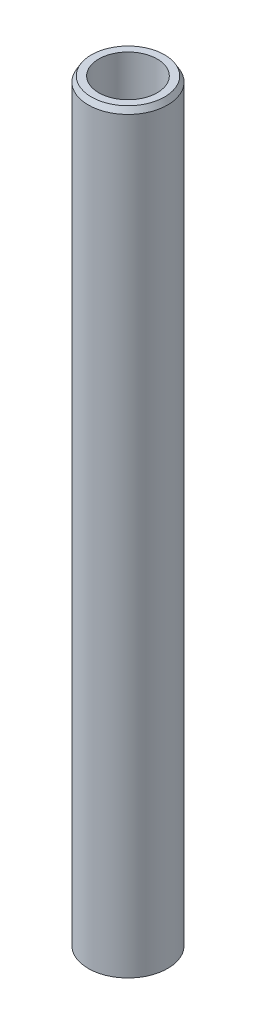
ISO-10303-21;
HEADER;
FILE_DESCRIPTION(('STEP AP214'),'2;1');
FILE_NAME('part.step','',(''),(''),'','','');
FILE_SCHEMA(('AUTOMOTIVE_DESIGN { 1 0 10303 214 1 1 1 1 }'));
ENDSEC;
DATA;
#1=APPLICATION_CONTEXT('core data for automotive mechanical design processes');
#2=APPLICATION_PROTOCOL_DEFINITION('international standard','automotive_design',2000,#1);
#3=PRODUCT_CONTEXT('',#1,'mechanical');
#4=PRODUCT('Part','Part','',(#3));
#5=PRODUCT_RELATED_PRODUCT_CATEGORY('part','',(#4));
#6=PRODUCT_DEFINITION_FORMATION('','',#4);
#7=PRODUCT_DEFINITION_CONTEXT('part definition',#1,'design');
#8=PRODUCT_DEFINITION('design','',#6,#7);
#9=PRODUCT_DEFINITION_SHAPE('','',#8);
#10=(LENGTH_UNIT() NAMED_UNIT(*) SI_UNIT(.MILLI.,.METRE.));
#11=(NAMED_UNIT(*) PLANE_ANGLE_UNIT() SI_UNIT($,.RADIAN.));
#12=(NAMED_UNIT(*) SI_UNIT($,.STERADIAN.) SOLID_ANGLE_UNIT());
#13=UNCERTAINTY_MEASURE_WITH_UNIT(LENGTH_MEASURE(1.E-05),#10,'distance_accuracy_value','');
#14=(GEOMETRIC_REPRESENTATION_CONTEXT(3) GLOBAL_UNCERTAINTY_ASSIGNED_CONTEXT((#13)) GLOBAL_UNIT_ASSIGNED_CONTEXT((#10,
#11,#12)) REPRESENTATION_CONTEXT('',''));
#15=CARTESIAN_POINT('',(0.,0.,0.));
#16=DIRECTION('',(0.,0.,1.));
#17=DIRECTION('',(1.,0.,0.));
#18=AXIS2_PLACEMENT_3D('',#15,#16,#17);
#19=CARTESIAN_POINT('',(0.,571.675702433147,0.));
#20=DIRECTION('',(0.,-1.,0.));
#21=DIRECTION('',(0.,0.,-1.));
#22=AXIS2_PLACEMENT_3D('',#19,#20,#21);
#23=CYLINDRICAL_SURFACE('',#22,30.);
#24=CARTESIAN_POINT('',(0.,567.618248378262,0.));
#25=DIRECTION('',(0.,1.,0.));
#26=DIRECTION('',(0.,0.,1.));
#27=AXIS2_PLACEMENT_3D('',#24,#25,#26);
#28=CIRCLE('',#27,30.);
#29=CARTESIAN_POINT('',(0.,567.618248378262,30.));
#30=VERTEX_POINT('',#29);
#31=EDGE_CURVE('E50',#30,#30,#28,.F.);
#32=ORIENTED_EDGE('',*,*,#31,.T.);
#33=EDGE_LOOP('',(#32));
#34=FACE_BOUND('',#33,.T.);
#35=CARTESIAN_POINT('',(0.,2.34257219081258,0.));
#36=DIRECTION('',(0.,1.,0.));
#37=DIRECTION('',(0.,0.,1.));
#38=AXIS2_PLACEMENT_3D('',#35,#36,#37);
#39=CIRCLE('',#38,30.);
#40=CARTESIAN_POINT('',(0.,2.34257219081258,30.));
#41=VERTEX_POINT('',#40);
#42=EDGE_CURVE('E51',#41,#41,#39,.T.);
#43=ORIENTED_EDGE('',*,*,#42,.T.);
#44=EDGE_LOOP('',(#43));
#45=FACE_BOUND('',#44,.T.);
#46=ADVANCED_FACE('F39',(#34,#45),#23,.T.);
#47=CARTESIAN_POINT('',(0.,571.675702433147,0.));
#48=DIRECTION('',(0.,1.,0.));
#49=DIRECTION('',(0.,0.,1.));
#50=AXIS2_PLACEMENT_3D('',#47,#48,#49);
#51=PLANE('',#50);
#52=CARTESIAN_POINT('',(0.,571.675702433147,0.));
#53=DIRECTION('',(0.,1.,0.));
#54=DIRECTION('',(0.,0.,1.));
#55=AXIS2_PLACEMENT_3D('',#52,#53,#54);
#56=CIRCLE('',#55,27.6574278091872);
#57=CARTESIAN_POINT('',(0.,571.675702433147,27.6574278091872));
#58=VERTEX_POINT('',#57);
#59=EDGE_CURVE('E54',#58,#58,#56,.T.);
#60=ORIENTED_EDGE('',*,*,#59,.T.);
#61=EDGE_LOOP('',(#60));
#62=FACE_BOUND('',#61,.T.);
#63=CARTESIAN_POINT('',(0.,571.675702433147,0.));
#64=DIRECTION('',(0.,1.,0.));
#65=DIRECTION('',(0.,0.,1.));
#66=AXIS2_PLACEMENT_3D('',#63,#64,#65);
#67=CIRCLE('',#66,22.1230328263732);
#68=CARTESIAN_POINT('',(0.,571.675702433147,22.1230328263732));
#69=VERTEX_POINT('',#68);
#70=EDGE_CURVE('E58',#69,#69,#67,.T.);
#71=ORIENTED_EDGE('',*,*,#70,.F.);
#72=EDGE_LOOP('',(#71));
#73=FACE_BOUND('',#72,.T.);
#74=ADVANCED_FACE('F69',(#62,#73),#51,.T.);
#75=CARTESIAN_POINT('',(0.,0.,0.));
#76=DIRECTION('',(0.,1.,0.));
#77=DIRECTION('',(0.,0.,1.));
#78=AXIS2_PLACEMENT_3D('',#75,#76,#77);
#79=PLANE('',#78);
#80=CARTESIAN_POINT('',(0.,0.,0.));
#81=DIRECTION('',(0.,1.,0.));
#82=DIRECTION('',(0.,0.,1.));
#83=AXIS2_PLACEMENT_3D('',#80,#81,#82);
#84=CIRCLE('',#83,25.9425459451146);
#85=CARTESIAN_POINT('',(0.,0.,25.9425459451146));
#86=VERTEX_POINT('',#85);
#87=EDGE_CURVE('E10',#86,#86,#84,.F.);
#88=ORIENTED_EDGE('',*,*,#87,.T.);
#89=EDGE_LOOP('',(#88));
#90=FACE_BOUND('',#89,.T.);
#91=CARTESIAN_POINT('',(0.,0.,0.));
#92=DIRECTION('',(0.,1.,0.));
#93=DIRECTION('',(0.,0.,1.));
#94=AXIS2_PLACEMENT_3D('',#91,#92,#93);
#95=CIRCLE('',#94,22.1230328263732);
#96=CARTESIAN_POINT('',(0.,0.,22.1230328263732));
#97=VERTEX_POINT('',#96);
#98=EDGE_CURVE('E63',#97,#97,#95,.T.);
#99=ORIENTED_EDGE('',*,*,#98,.T.);
#100=EDGE_LOOP('',(#99));
#101=FACE_BOUND('',#100,.T.);
#102=ADVANCED_FACE('F75',(#90,#101),#79,.F.);
#103=CARTESIAN_POINT('',(0.,571.675702433147,0.));
#104=DIRECTION('',(0.,-1.,0.));
#105=DIRECTION('',(0.,0.,-1.));
#106=AXIS2_PLACEMENT_3D('',#103,#104,#105);
#107=CYLINDRICAL_SURFACE('',#106,22.1230328263732);
#108=ORIENTED_EDGE('',*,*,#70,.T.);
#109=EDGE_LOOP('',(#108));
#110=FACE_BOUND('',#109,.T.);
#111=ORIENTED_EDGE('',*,*,#98,.F.);
#112=EDGE_LOOP('',(#111));
#113=FACE_BOUND('',#112,.T.);
#114=ADVANCED_FACE('F70',(#110,#113),#107,.F.);
#115=CARTESIAN_POINT('',(0.,571.675702433147,0.));
#116=DIRECTION('',(0.,-1.,0.));
#117=DIRECTION('',(0.,0.,-1.));
#118=AXIS2_PLACEMENT_3D('',#115,#116,#117);
#119=CONICAL_SURFACE('',#118,27.6574278091872,0.523598775598307);
#120=ORIENTED_EDGE('',*,*,#31,.F.);
#121=EDGE_LOOP('',(#120));
#122=FACE_BOUND('',#121,.T.);
#123=ORIENTED_EDGE('',*,*,#59,.F.);
#124=EDGE_LOOP('',(#123));
#125=FACE_BOUND('',#124,.T.);
#126=ADVANCED_FACE('F81',(#122,#125),#119,.T.);
#127=CARTESIAN_POINT('',(0.,2.34257219081258,0.));
#128=DIRECTION('',(0.,1.,0.));
#129=DIRECTION('',(0.,0.,1.));
#130=AXIS2_PLACEMENT_3D('',#127,#128,#129);
#131=CONICAL_SURFACE('',#130,30.,1.04719755119661);
#132=ORIENTED_EDGE('',*,*,#87,.F.);
#133=EDGE_LOOP('',(#132));
#134=FACE_BOUND('',#133,.T.);
#135=ORIENTED_EDGE('',*,*,#42,.F.);
#136=EDGE_LOOP('',(#135));
#137=FACE_BOUND('',#136,.T.);
#138=ADVANCED_FACE('F45',(#134,#137),#131,.T.);
#139=CLOSED_SHELL('',(#46,#74,#102,#114,#126,#138));
#140=MANIFOLD_SOLID_BREP('B2',#139);
#141=ADVANCED_BREP_SHAPE_REPRESENTATION('',(#18,#140),#14);
#142=SHAPE_DEFINITION_REPRESENTATION(#9,#141);
ENDSEC;
END-ISO-10303-21;
